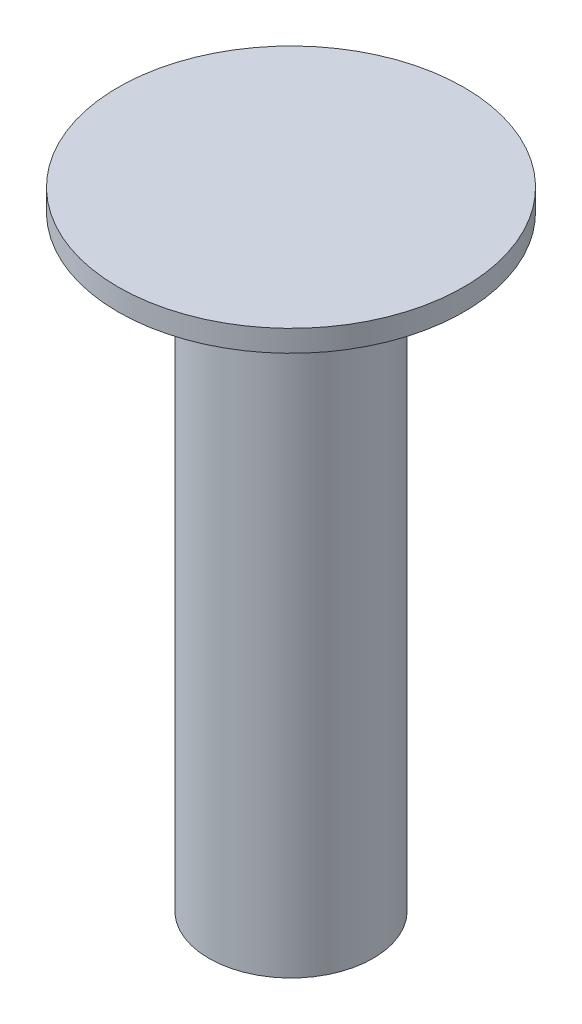
ISO-10303-21;
HEADER;
FILE_DESCRIPTION(('STEP AP214'),'2;1');
FILE_NAME('part.step','',(''),(''),'','','');
FILE_SCHEMA(('AUTOMOTIVE_DESIGN { 1 0 10303 214 1 1 1 1 }'));
ENDSEC;
DATA;
#1=APPLICATION_CONTEXT('core data for automotive mechanical design processes');
#2=APPLICATION_PROTOCOL_DEFINITION('international standard','automotive_design',2000,#1);
#3=PRODUCT_CONTEXT('',#1,'mechanical');
#4=PRODUCT('Part','Part','',(#3));
#5=PRODUCT_RELATED_PRODUCT_CATEGORY('part','',(#4));
#6=PRODUCT_DEFINITION_FORMATION('','',#4);
#7=PRODUCT_DEFINITION_CONTEXT('part definition',#1,'design');
#8=PRODUCT_DEFINITION('design','',#6,#7);
#9=PRODUCT_DEFINITION_SHAPE('','',#8);
#10=(LENGTH_UNIT() NAMED_UNIT(*) SI_UNIT(.MILLI.,.METRE.));
#11=(NAMED_UNIT(*) PLANE_ANGLE_UNIT() SI_UNIT($,.RADIAN.));
#12=(NAMED_UNIT(*) SI_UNIT($,.STERADIAN.) SOLID_ANGLE_UNIT());
#13=UNCERTAINTY_MEASURE_WITH_UNIT(LENGTH_MEASURE(1.E-05),#10,'distance_accuracy_value','');
#14=(GEOMETRIC_REPRESENTATION_CONTEXT(3) GLOBAL_UNCERTAINTY_ASSIGNED_CONTEXT((#13)) GLOBAL_UNIT_ASSIGNED_CONTEXT((#10,
#11,#12)) REPRESENTATION_CONTEXT('',''));
#15=CARTESIAN_POINT('',(0.,0.,0.));
#16=DIRECTION('',(0.,0.,1.));
#17=DIRECTION('',(1.,0.,0.));
#18=AXIS2_PLACEMENT_3D('',#15,#16,#17);
#19=CARTESIAN_POINT('',(0.,14.,0.));
#20=DIRECTION('',(0.,-1.,0.));
#21=DIRECTION('',(0.,0.,-1.));
#22=AXIS2_PLACEMENT_3D('',#19,#20,#21);
#23=CYLINDRICAL_SURFACE('',#22,3.8);
#24=CARTESIAN_POINT('',(0.,14.,0.));
#25=DIRECTION('',(0.,1.,0.));
#26=DIRECTION('',(0.,0.,1.));
#27=AXIS2_PLACEMENT_3D('',#24,#25,#26);
#28=CIRCLE('',#27,3.8);
#29=CARTESIAN_POINT('',(0.,14.,3.8));
#30=VERTEX_POINT('',#29);
#31=EDGE_CURVE('E10',#30,#30,#28,.T.);
#32=ORIENTED_EDGE('',*,*,#31,.F.);
#33=EDGE_LOOP('',(#32));
#34=FACE_BOUND('',#33,.T.);
#35=CARTESIAN_POINT('',(0.,-14.,0.));
#36=DIRECTION('',(0.,1.,0.));
#37=DIRECTION('',(0.,0.,1.));
#38=AXIS2_PLACEMENT_3D('',#35,#36,#37);
#39=CIRCLE('',#38,3.8);
#40=CARTESIAN_POINT('',(0.,-14.,3.8));
#41=VERTEX_POINT('',#40);
#42=EDGE_CURVE('E34',#41,#41,#39,.T.);
#43=ORIENTED_EDGE('',*,*,#42,.T.);
#44=EDGE_LOOP('',(#43));
#45=FACE_BOUND('',#44,.T.);
#46=ADVANCED_FACE('F31',(#34,#45),#23,.T.);
#47=CARTESIAN_POINT('',(0.,-14.,0.));
#48=DIRECTION('',(0.,1.,0.));
#49=DIRECTION('',(0.,0.,1.));
#50=AXIS2_PLACEMENT_3D('',#47,#48,#49);
#51=PLANE('',#50);
#52=ORIENTED_EDGE('',*,*,#42,.F.);
#53=EDGE_LOOP('',(#52));
#54=FACE_BOUND('',#53,.T.);
#55=ADVANCED_FACE('F54',(#54),#51,.F.);
#56=CARTESIAN_POINT('',(0.,15.,0.));
#57=DIRECTION('',(0.,-1.,0.));
#58=DIRECTION('',(0.,0.,-1.));
#59=AXIS2_PLACEMENT_3D('',#56,#57,#58);
#60=CYLINDRICAL_SURFACE('',#59,8.);
#61=CARTESIAN_POINT('',(0.,15.,0.));
#62=DIRECTION('',(0.,1.,0.));
#63=DIRECTION('',(0.,0.,1.));
#64=AXIS2_PLACEMENT_3D('',#61,#62,#63);
#65=CIRCLE('',#64,8.);
#66=CARTESIAN_POINT('',(0.,15.,8.));
#67=VERTEX_POINT('',#66);
#68=EDGE_CURVE('E41',#67,#67,#65,.T.);
#69=ORIENTED_EDGE('',*,*,#68,.F.);
#70=EDGE_LOOP('',(#69));
#71=FACE_BOUND('',#70,.T.);
#72=CARTESIAN_POINT('',(0.,14.,0.));
#73=DIRECTION('',(0.,1.,0.));
#74=DIRECTION('',(0.,0.,1.));
#75=AXIS2_PLACEMENT_3D('',#72,#73,#74);
#76=CIRCLE('',#75,8.);
#77=CARTESIAN_POINT('',(0.,14.,8.));
#78=VERTEX_POINT('',#77);
#79=EDGE_CURVE('E43',#78,#78,#76,.T.);
#80=ORIENTED_EDGE('',*,*,#79,.T.);
#81=EDGE_LOOP('',(#80));
#82=FACE_BOUND('',#81,.T.);
#83=ADVANCED_FACE('F51',(#71,#82),#60,.T.);
#84=CARTESIAN_POINT('',(0.,15.,0.));
#85=DIRECTION('',(0.,1.,0.));
#86=DIRECTION('',(0.,0.,1.));
#87=AXIS2_PLACEMENT_3D('',#84,#85,#86);
#88=PLANE('',#87);
#89=ORIENTED_EDGE('',*,*,#68,.T.);
#90=EDGE_LOOP('',(#89));
#91=FACE_BOUND('',#90,.T.);
#92=ADVANCED_FACE('F49',(#91),#88,.T.);
#93=CARTESIAN_POINT('',(0.,14.,0.));
#94=DIRECTION('',(0.,1.,0.));
#95=DIRECTION('',(0.,0.,1.));
#96=AXIS2_PLACEMENT_3D('',#93,#94,#95);
#97=PLANE('',#96);
#98=ORIENTED_EDGE('',*,*,#31,.T.);
#99=EDGE_LOOP('',(#98));
#100=FACE_BOUND('',#99,.T.);
#101=ORIENTED_EDGE('',*,*,#79,.F.);
#102=EDGE_LOOP('',(#101));
#103=FACE_BOUND('',#102,.T.);
#104=ADVANCED_FACE('F58',(#100,#103),#97,.F.);
#105=CLOSED_SHELL('',(#46,#55,#83,#92,#104));
#106=MANIFOLD_SOLID_BREP('B2',#105);
#107=ADVANCED_BREP_SHAPE_REPRESENTATION('',(#18,#106),#14);
#108=SHAPE_DEFINITION_REPRESENTATION(#9,#107);
ENDSEC;
END-ISO-10303-21;
